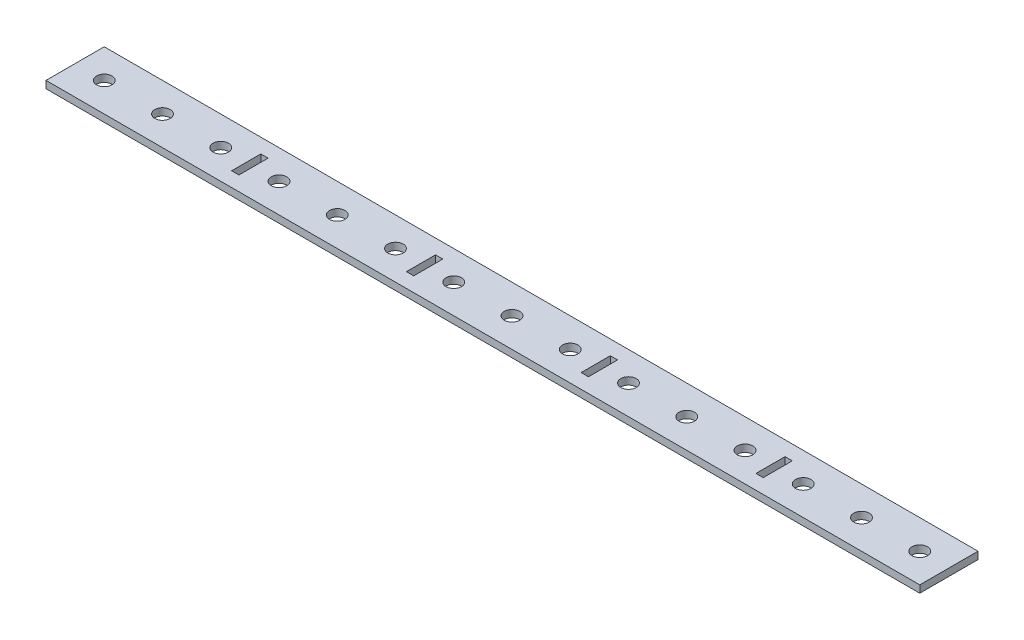
ISO-10303-21;
HEADER;
FILE_DESCRIPTION(('STEP AP214'),'2;1');
FILE_NAME('part.step','',(''),(''),'','','');
FILE_SCHEMA(('AUTOMOTIVE_DESIGN { 1 0 10303 214 1 1 1 1 }'));
ENDSEC;
DATA;
#1=APPLICATION_CONTEXT('core data for automotive mechanical design processes');
#2=APPLICATION_PROTOCOL_DEFINITION('international standard','automotive_design',2000,#1);
#3=PRODUCT_CONTEXT('',#1,'mechanical');
#4=PRODUCT('Part','Part','',(#3));
#5=PRODUCT_RELATED_PRODUCT_CATEGORY('part','',(#4));
#6=PRODUCT_DEFINITION_FORMATION('','',#4);
#7=PRODUCT_DEFINITION_CONTEXT('part definition',#1,'design');
#8=PRODUCT_DEFINITION('design','',#6,#7);
#9=PRODUCT_DEFINITION_SHAPE('','',#8);
#10=(LENGTH_UNIT() NAMED_UNIT(*) SI_UNIT(.MILLI.,.METRE.));
#11=(NAMED_UNIT(*) PLANE_ANGLE_UNIT() SI_UNIT($,.RADIAN.));
#12=(NAMED_UNIT(*) SI_UNIT($,.STERADIAN.) SOLID_ANGLE_UNIT());
#13=UNCERTAINTY_MEASURE_WITH_UNIT(LENGTH_MEASURE(1.E-05),#10,'distance_accuracy_value','');
#14=(GEOMETRIC_REPRESENTATION_CONTEXT(3) GLOBAL_UNCERTAINTY_ASSIGNED_CONTEXT((#13)) GLOBAL_UNIT_ASSIGNED_CONTEXT((#10,
#11,#12)) REPRESENTATION_CONTEXT('',''));
#15=CARTESIAN_POINT('',(0.,0.,0.));
#16=DIRECTION('',(0.,0.,1.));
#17=DIRECTION('',(1.,0.,0.));
#18=AXIS2_PLACEMENT_3D('',#15,#16,#17);
#19=CARTESIAN_POINT('',(303.2125,0.,-6.35));
#20=DIRECTION('',(0.,0.,1.));
#21=DIRECTION('',(1.,0.,0.));
#22=AXIS2_PLACEMENT_3D('',#19,#20,#21);
#23=PLANE('',#22);
#24=DIRECTION('',(1.,0.,0.));
#25=VECTOR('',#24,1.);
#26=CARTESIAN_POINT('',(303.2125,3.175,-6.35));
#27=LINE('',#26,#25);
#28=CARTESIAN_POINT('',(303.2125,3.175,-6.35));
#29=VERTEX_POINT('',#28);
#30=CARTESIAN_POINT('',(306.3875,3.175,-6.35));
#31=VERTEX_POINT('',#30);
#32=EDGE_CURVE('E404',#29,#31,#27,.T.);
#33=ORIENTED_EDGE('',*,*,#32,.T.);
#34=DIRECTION('',(0.,1.,0.));
#35=VECTOR('',#34,1.);
#36=CARTESIAN_POINT('',(306.3875,0.,-6.35));
#37=LINE('',#36,#35);
#38=CARTESIAN_POINT('',(306.3875,0.,-6.35));
#39=VERTEX_POINT('',#38);
#40=EDGE_CURVE('E11',#39,#31,#37,.T.);
#41=ORIENTED_EDGE('',*,*,#40,.F.);
#42=DIRECTION('',(1.,0.,0.));
#43=VECTOR('',#42,1.);
#44=CARTESIAN_POINT('',(303.2125,0.,-6.35));
#45=LINE('',#44,#43);
#46=CARTESIAN_POINT('',(303.2125,0.,-6.35));
#47=VERTEX_POINT('',#46);
#48=EDGE_CURVE('E408',#47,#39,#45,.T.);
#49=ORIENTED_EDGE('',*,*,#48,.F.);
#50=DIRECTION('',(0.,1.,0.));
#51=VECTOR('',#50,1.);
#52=CARTESIAN_POINT('',(303.2125,0.,-6.35));
#53=LINE('',#52,#51);
#54=EDGE_CURVE('E413',#47,#29,#53,.T.);
#55=ORIENTED_EDGE('',*,*,#54,.T.);
#56=EDGE_LOOP('',(#33,#41,#49,#55));
#57=FACE_BOUND('',#56,.T.);
#58=ADVANCED_FACE('F33',(#57),#23,.F.);
#59=CARTESIAN_POINT('',(306.3875,0.,-19.05));
#60=DIRECTION('',(1.,0.,0.));
#61=DIRECTION('',(0.,0.,-1.));
#62=AXIS2_PLACEMENT_3D('',#59,#60,#61);
#63=PLANE('',#62);
#64=DIRECTION('',(0.,0.,-1.));
#65=VECTOR('',#64,1.);
#66=CARTESIAN_POINT('',(306.3875,3.175,-19.05));
#67=LINE('',#66,#65);
#68=CARTESIAN_POINT('',(306.3875,3.175,-19.05));
#69=VERTEX_POINT('',#68);
#70=EDGE_CURVE('E401',#31,#69,#67,.T.);
#71=ORIENTED_EDGE('',*,*,#70,.T.);
#72=DIRECTION('',(0.,1.,0.));
#73=VECTOR('',#72,1.);
#74=CARTESIAN_POINT('',(306.3875,0.,-19.05));
#75=LINE('',#74,#73);
#76=CARTESIAN_POINT('',(306.3875,0.,-19.05));
#77=VERTEX_POINT('',#76);
#78=EDGE_CURVE('E40',#77,#69,#75,.T.);
#79=ORIENTED_EDGE('',*,*,#78,.F.);
#80=DIRECTION('',(0.,0.,-1.));
#81=VECTOR('',#80,1.);
#82=CARTESIAN_POINT('',(306.3875,0.,-19.05));
#83=LINE('',#82,#81);
#84=EDGE_CURVE('E54',#39,#77,#83,.T.);
#85=ORIENTED_EDGE('',*,*,#84,.F.);
#86=ORIENTED_EDGE('',*,*,#40,.T.);
#87=EDGE_LOOP('',(#71,#79,#85,#86));
#88=FACE_BOUND('',#87,.T.);
#89=ADVANCED_FACE('F423',(#88),#63,.F.);
#90=CARTESIAN_POINT('',(303.2125,0.,-19.05));
#91=DIRECTION('',(0.,0.,-1.));
#92=DIRECTION('',(-1.,0.,0.));
#93=AXIS2_PLACEMENT_3D('',#90,#91,#92);
#94=PLANE('',#93);
#95=DIRECTION('',(-1.,0.,0.));
#96=VECTOR('',#95,1.);
#97=CARTESIAN_POINT('',(303.2125,3.175,-19.05));
#98=LINE('',#97,#96);
#99=CARTESIAN_POINT('',(303.2125,3.175,-19.05));
#100=VERTEX_POINT('',#99);
#101=EDGE_CURVE('E398',#69,#100,#98,.T.);
#102=ORIENTED_EDGE('',*,*,#101,.T.);
#103=DIRECTION('',(0.,1.,0.));
#104=VECTOR('',#103,1.);
#105=CARTESIAN_POINT('',(303.2125,0.,-19.05));
#106=LINE('',#105,#104);
#107=CARTESIAN_POINT('',(303.2125,0.,-19.05));
#108=VERTEX_POINT('',#107);
#109=EDGE_CURVE('E416',#108,#100,#106,.T.);
#110=ORIENTED_EDGE('',*,*,#109,.F.);
#111=DIRECTION('',(-1.,0.,0.));
#112=VECTOR('',#111,1.);
#113=CARTESIAN_POINT('',(303.2125,0.,-19.05));
#114=LINE('',#113,#112);
#115=EDGE_CURVE('E411',#77,#108,#114,.T.);
#116=ORIENTED_EDGE('',*,*,#115,.F.);
#117=ORIENTED_EDGE('',*,*,#78,.T.);
#118=EDGE_LOOP('',(#102,#110,#116,#117));
#119=FACE_BOUND('',#118,.T.);
#120=ADVANCED_FACE('F420',(#119),#94,.F.);
#121=CARTESIAN_POINT('',(303.2125,0.,-19.05));
#122=DIRECTION('',(-1.,0.,0.));
#123=DIRECTION('',(0.,0.,1.));
#124=AXIS2_PLACEMENT_3D('',#121,#122,#123);
#125=PLANE('',#124);
#126=DIRECTION('',(0.,0.,1.));
#127=VECTOR('',#126,1.);
#128=CARTESIAN_POINT('',(303.2125,3.175,-19.05));
#129=LINE('',#128,#127);
#130=EDGE_CURVE('E396',#100,#29,#129,.T.);
#131=ORIENTED_EDGE('',*,*,#130,.T.);
#132=ORIENTED_EDGE('',*,*,#54,.F.);
#133=DIRECTION('',(0.,0.,1.));
#134=VECTOR('',#133,1.);
#135=CARTESIAN_POINT('',(303.2125,0.,-19.05));
#136=LINE('',#135,#134);
#137=EDGE_CURVE('E47',#108,#47,#136,.T.);
#138=ORIENTED_EDGE('',*,*,#137,.F.);
#139=ORIENTED_EDGE('',*,*,#109,.T.);
#140=EDGE_LOOP('',(#131,#132,#138,#139));
#141=FACE_BOUND('',#140,.T.);
#142=ADVANCED_FACE('F429',(#141),#125,.F.);
#143=CARTESIAN_POINT('',(227.0125,0.,-6.35));
#144=DIRECTION('',(0.,0.,1.));
#145=DIRECTION('',(1.,0.,0.));
#146=AXIS2_PLACEMENT_3D('',#143,#144,#145);
#147=PLANE('',#146);
#148=DIRECTION('',(1.,0.,0.));
#149=VECTOR('',#148,1.);
#150=CARTESIAN_POINT('',(227.0125,3.175,-6.35));
#151=LINE('',#150,#149);
#152=CARTESIAN_POINT('',(227.0125,3.175,-6.35));
#153=VERTEX_POINT('',#152);
#154=CARTESIAN_POINT('',(230.1875,3.175,-6.35));
#155=VERTEX_POINT('',#154);
#156=EDGE_CURVE('E372',#153,#155,#151,.T.);
#157=ORIENTED_EDGE('',*,*,#156,.T.);
#158=DIRECTION('',(0.,1.,0.));
#159=VECTOR('',#158,1.);
#160=CARTESIAN_POINT('',(230.1875,0.,-6.35));
#161=LINE('',#160,#159);
#162=CARTESIAN_POINT('',(230.1875,0.,-6.35));
#163=VERTEX_POINT('',#162);
#164=EDGE_CURVE('E393',#163,#155,#161,.T.);
#165=ORIENTED_EDGE('',*,*,#164,.F.);
#166=DIRECTION('',(1.,0.,0.));
#167=VECTOR('',#166,1.);
#168=CARTESIAN_POINT('',(227.0125,0.,-6.35));
#169=LINE('',#168,#167);
#170=CARTESIAN_POINT('',(227.0125,0.,-6.35));
#171=VERTEX_POINT('',#170);
#172=EDGE_CURVE('E377',#171,#163,#169,.T.);
#173=ORIENTED_EDGE('',*,*,#172,.F.);
#174=DIRECTION('',(0.,1.,0.));
#175=VECTOR('',#174,1.);
#176=CARTESIAN_POINT('',(227.0125,0.,-6.35));
#177=LINE('',#176,#175);
#178=EDGE_CURVE('E384',#171,#153,#177,.T.);
#179=ORIENTED_EDGE('',*,*,#178,.T.);
#180=EDGE_LOOP('',(#157,#165,#173,#179));
#181=FACE_BOUND('',#180,.T.);
#182=ADVANCED_FACE('F431',(#181),#147,.F.);
#183=CARTESIAN_POINT('',(230.1875,0.,-19.05));
#184=DIRECTION('',(1.,0.,0.));
#185=DIRECTION('',(0.,0.,-1.));
#186=AXIS2_PLACEMENT_3D('',#183,#184,#185);
#187=PLANE('',#186);
#188=DIRECTION('',(0.,0.,-1.));
#189=VECTOR('',#188,1.);
#190=CARTESIAN_POINT('',(230.1875,3.175,-19.05));
#191=LINE('',#190,#189);
#192=CARTESIAN_POINT('',(230.1875,3.175,-19.05));
#193=VERTEX_POINT('',#192);
#194=EDGE_CURVE('E369',#155,#193,#191,.T.);
#195=ORIENTED_EDGE('',*,*,#194,.T.);
#196=DIRECTION('',(0.,1.,0.));
#197=VECTOR('',#196,1.);
#198=CARTESIAN_POINT('',(230.1875,0.,-19.05));
#199=LINE('',#198,#197);
#200=CARTESIAN_POINT('',(230.1875,0.,-19.05));
#201=VERTEX_POINT('',#200);
#202=EDGE_CURVE('E390',#201,#193,#199,.T.);
#203=ORIENTED_EDGE('',*,*,#202,.F.);
#204=DIRECTION('',(0.,0.,-1.));
#205=VECTOR('',#204,1.);
#206=CARTESIAN_POINT('',(230.1875,0.,-19.05));
#207=LINE('',#206,#205);
#208=EDGE_CURVE('E379',#163,#201,#207,.T.);
#209=ORIENTED_EDGE('',*,*,#208,.F.);
#210=ORIENTED_EDGE('',*,*,#164,.T.);
#211=EDGE_LOOP('',(#195,#203,#209,#210));
#212=FACE_BOUND('',#211,.T.);
#213=ADVANCED_FACE('F437',(#212),#187,.F.);
#214=CARTESIAN_POINT('',(227.0125,0.,-19.05));
#215=DIRECTION('',(0.,0.,-1.));
#216=DIRECTION('',(-1.,0.,0.));
#217=AXIS2_PLACEMENT_3D('',#214,#215,#216);
#218=PLANE('',#217);
#219=DIRECTION('',(-1.,0.,0.));
#220=VECTOR('',#219,1.);
#221=CARTESIAN_POINT('',(227.0125,3.175,-19.05));
#222=LINE('',#221,#220);
#223=CARTESIAN_POINT('',(227.0125,3.175,-19.05));
#224=VERTEX_POINT('',#223);
#225=EDGE_CURVE('E366',#193,#224,#222,.T.);
#226=ORIENTED_EDGE('',*,*,#225,.T.);
#227=DIRECTION('',(0.,1.,0.));
#228=VECTOR('',#227,1.);
#229=CARTESIAN_POINT('',(227.0125,0.,-19.05));
#230=LINE('',#229,#228);
#231=CARTESIAN_POINT('',(227.0125,0.,-19.05));
#232=VERTEX_POINT('',#231);
#233=EDGE_CURVE('E387',#232,#224,#230,.T.);
#234=ORIENTED_EDGE('',*,*,#233,.F.);
#235=DIRECTION('',(-1.,0.,0.));
#236=VECTOR('',#235,1.);
#237=CARTESIAN_POINT('',(227.0125,0.,-19.05));
#238=LINE('',#237,#236);
#239=EDGE_CURVE('E381',#201,#232,#238,.T.);
#240=ORIENTED_EDGE('',*,*,#239,.F.);
#241=ORIENTED_EDGE('',*,*,#202,.T.);
#242=EDGE_LOOP('',(#226,#234,#240,#241));
#243=FACE_BOUND('',#242,.T.);
#244=ADVANCED_FACE('F470',(#243),#218,.F.);
#245=CARTESIAN_POINT('',(227.0125,0.,-19.05));
#246=DIRECTION('',(-1.,0.,0.));
#247=DIRECTION('',(0.,0.,1.));
#248=AXIS2_PLACEMENT_3D('',#245,#246,#247);
#249=PLANE('',#248);
#250=DIRECTION('',(0.,0.,1.));
#251=VECTOR('',#250,1.);
#252=CARTESIAN_POINT('',(227.0125,3.175,-19.05));
#253=LINE('',#252,#251);
#254=EDGE_CURVE('E364',#224,#153,#253,.T.);
#255=ORIENTED_EDGE('',*,*,#254,.T.);
#256=ORIENTED_EDGE('',*,*,#178,.F.);
#257=DIRECTION('',(0.,0.,1.));
#258=VECTOR('',#257,1.);
#259=CARTESIAN_POINT('',(227.0125,0.,-19.05));
#260=LINE('',#259,#258);
#261=EDGE_CURVE('E375',#232,#171,#260,.T.);
#262=ORIENTED_EDGE('',*,*,#261,.F.);
#263=ORIENTED_EDGE('',*,*,#233,.T.);
#264=EDGE_LOOP('',(#255,#256,#262,#263));
#265=FACE_BOUND('',#264,.T.);
#266=ADVANCED_FACE('F480',(#265),#249,.F.);
#267=CARTESIAN_POINT('',(368.3,3.175,-12.7));
#268=DIRECTION('',(0.,1.,0.));
#269=DIRECTION('',(0.,0.,1.));
#270=AXIS2_PLACEMENT_3D('',#267,#268,#269);
#271=CYLINDRICAL_SURFACE('',#270,3.3782);
#272=CARTESIAN_POINT('',(368.3,0.,-12.7));
#273=DIRECTION('',(0.,1.,0.));
#274=DIRECTION('',(0.,0.,1.));
#275=AXIS2_PLACEMENT_3D('',#272,#273,#274);
#276=CIRCLE('',#275,3.3782);
#277=CARTESIAN_POINT('',(368.3,0.,-9.3218));
#278=VERTEX_POINT('',#277);
#279=EDGE_CURVE('E358',#278,#278,#276,.T.);
#280=ORIENTED_EDGE('',*,*,#279,.F.);
#281=EDGE_LOOP('',(#280));
#282=FACE_BOUND('',#281,.T.);
#283=CARTESIAN_POINT('',(368.3,3.175,-12.7));
#284=DIRECTION('',(0.,1.,0.));
#285=DIRECTION('',(0.,0.,1.));
#286=AXIS2_PLACEMENT_3D('',#283,#284,#285);
#287=CIRCLE('',#286,3.3782);
#288=CARTESIAN_POINT('',(368.3,3.175,-9.3218));
#289=VERTEX_POINT('',#288);
#290=EDGE_CURVE('E361',#289,#289,#287,.T.);
#291=ORIENTED_EDGE('',*,*,#290,.T.);
#292=EDGE_LOOP('',(#291));
#293=FACE_BOUND('',#292,.T.);
#294=ADVANCED_FACE('F490',(#282,#293),#271,.F.);
#295=CARTESIAN_POINT('',(342.9,3.175,-12.7));
#296=DIRECTION('',(0.,1.,0.));
#297=DIRECTION('',(0.,0.,1.));
#298=AXIS2_PLACEMENT_3D('',#295,#296,#297);
#299=CYLINDRICAL_SURFACE('',#298,3.3782);
#300=CARTESIAN_POINT('',(342.9,0.,-12.7));
#301=DIRECTION('',(0.,1.,0.));
#302=DIRECTION('',(0.,0.,1.));
#303=AXIS2_PLACEMENT_3D('',#300,#301,#302);
#304=CIRCLE('',#303,3.3782);
#305=CARTESIAN_POINT('',(342.9,0.,-9.3218));
#306=VERTEX_POINT('',#305);
#307=EDGE_CURVE('E352',#306,#306,#304,.T.);
#308=ORIENTED_EDGE('',*,*,#307,.F.);
#309=EDGE_LOOP('',(#308));
#310=FACE_BOUND('',#309,.T.);
#311=CARTESIAN_POINT('',(342.9,3.175,-12.7));
#312=DIRECTION('',(0.,1.,0.));
#313=DIRECTION('',(0.,0.,1.));
#314=AXIS2_PLACEMENT_3D('',#311,#312,#313);
#315=CIRCLE('',#314,3.3782);
#316=CARTESIAN_POINT('',(342.9,3.175,-9.3218));
#317=VERTEX_POINT('',#316);
#318=EDGE_CURVE('E355',#317,#317,#315,.T.);
#319=ORIENTED_EDGE('',*,*,#318,.T.);
#320=EDGE_LOOP('',(#319));
#321=FACE_BOUND('',#320,.T.);
#322=ADVANCED_FACE('F636',(#310,#321),#299,.F.);
#323=CARTESIAN_POINT('',(317.5,3.175,-12.7));
#324=DIRECTION('',(0.,1.,0.));
#325=DIRECTION('',(0.,0.,1.));
#326=AXIS2_PLACEMENT_3D('',#323,#324,#325);
#327=CYLINDRICAL_SURFACE('',#326,3.3782);
#328=CARTESIAN_POINT('',(317.5,0.,-12.7));
#329=DIRECTION('',(0.,1.,0.));
#330=DIRECTION('',(0.,0.,1.));
#331=AXIS2_PLACEMENT_3D('',#328,#329,#330);
#332=CIRCLE('',#331,3.3782);
#333=CARTESIAN_POINT('',(317.5,0.,-9.3218));
#334=VERTEX_POINT('',#333);
#335=EDGE_CURVE('E346',#334,#334,#332,.T.);
#336=ORIENTED_EDGE('',*,*,#335,.F.);
#337=EDGE_LOOP('',(#336));
#338=FACE_BOUND('',#337,.T.);
#339=CARTESIAN_POINT('',(317.5,3.175,-12.7));
#340=DIRECTION('',(0.,1.,0.));
#341=DIRECTION('',(0.,0.,1.));
#342=AXIS2_PLACEMENT_3D('',#339,#340,#341);
#343=CIRCLE('',#342,3.3782);
#344=CARTESIAN_POINT('',(317.5,3.175,-9.3218));
#345=VERTEX_POINT('',#344);
#346=EDGE_CURVE('E349',#345,#345,#343,.T.);
#347=ORIENTED_EDGE('',*,*,#346,.T.);
#348=EDGE_LOOP('',(#347));
#349=FACE_BOUND('',#348,.T.);
#350=ADVANCED_FACE('F632',(#338,#349),#327,.F.);
#351=CARTESIAN_POINT('',(292.1,3.175,-12.7));
#352=DIRECTION('',(0.,1.,0.));
#353=DIRECTION('',(0.,0.,1.));
#354=AXIS2_PLACEMENT_3D('',#351,#352,#353);
#355=CYLINDRICAL_SURFACE('',#354,3.3782);
#356=CARTESIAN_POINT('',(292.1,0.,-12.7));
#357=DIRECTION('',(0.,1.,0.));
#358=DIRECTION('',(0.,0.,1.));
#359=AXIS2_PLACEMENT_3D('',#356,#357,#358);
#360=CIRCLE('',#359,3.3782);
#361=CARTESIAN_POINT('',(292.1,0.,-9.3218));
#362=VERTEX_POINT('',#361);
#363=EDGE_CURVE('E340',#362,#362,#360,.T.);
#364=ORIENTED_EDGE('',*,*,#363,.F.);
#365=EDGE_LOOP('',(#364));
#366=FACE_BOUND('',#365,.T.);
#367=CARTESIAN_POINT('',(292.1,3.175,-12.7));
#368=DIRECTION('',(0.,1.,0.));
#369=DIRECTION('',(0.,0.,1.));
#370=AXIS2_PLACEMENT_3D('',#367,#368,#369);
#371=CIRCLE('',#370,3.3782);
#372=CARTESIAN_POINT('',(292.1,3.175,-9.3218));
#373=VERTEX_POINT('',#372);
#374=EDGE_CURVE('E343',#373,#373,#371,.T.);
#375=ORIENTED_EDGE('',*,*,#374,.T.);
#376=EDGE_LOOP('',(#375));
#377=FACE_BOUND('',#376,.T.);
#378=ADVANCED_FACE('F628',(#366,#377),#355,.F.);
#379=CARTESIAN_POINT('',(266.7,3.175,-12.7));
#380=DIRECTION('',(0.,1.,0.));
#381=DIRECTION('',(0.,0.,1.));
#382=AXIS2_PLACEMENT_3D('',#379,#380,#381);
#383=CYLINDRICAL_SURFACE('',#382,3.3782);
#384=CARTESIAN_POINT('',(266.7,0.,-12.7));
#385=DIRECTION('',(0.,1.,0.));
#386=DIRECTION('',(0.,0.,1.));
#387=AXIS2_PLACEMENT_3D('',#384,#385,#386);
#388=CIRCLE('',#387,3.3782);
#389=CARTESIAN_POINT('',(266.7,0.,-9.3218));
#390=VERTEX_POINT('',#389);
#391=EDGE_CURVE('E334',#390,#390,#388,.T.);
#392=ORIENTED_EDGE('',*,*,#391,.F.);
#393=EDGE_LOOP('',(#392));
#394=FACE_BOUND('',#393,.T.);
#395=CARTESIAN_POINT('',(266.7,3.175,-12.7));
#396=DIRECTION('',(0.,1.,0.));
#397=DIRECTION('',(0.,0.,1.));
#398=AXIS2_PLACEMENT_3D('',#395,#396,#397);
#399=CIRCLE('',#398,3.3782);
#400=CARTESIAN_POINT('',(266.7,3.175,-9.3218));
#401=VERTEX_POINT('',#400);
#402=EDGE_CURVE('E337',#401,#401,#399,.T.);
#403=ORIENTED_EDGE('',*,*,#402,.T.);
#404=EDGE_LOOP('',(#403));
#405=FACE_BOUND('',#404,.T.);
#406=ADVANCED_FACE('F624',(#394,#405),#383,.F.);
#407=CARTESIAN_POINT('',(241.3,3.175,-12.7));
#408=DIRECTION('',(0.,1.,0.));
#409=DIRECTION('',(0.,0.,1.));
#410=AXIS2_PLACEMENT_3D('',#407,#408,#409);
#411=CYLINDRICAL_SURFACE('',#410,3.3782);
#412=CARTESIAN_POINT('',(241.3,0.,-12.7));
#413=DIRECTION('',(0.,1.,0.));
#414=DIRECTION('',(0.,0.,1.));
#415=AXIS2_PLACEMENT_3D('',#412,#413,#414);
#416=CIRCLE('',#415,3.3782);
#417=CARTESIAN_POINT('',(241.3,0.,-9.3218));
#418=VERTEX_POINT('',#417);
#419=EDGE_CURVE('E328',#418,#418,#416,.T.);
#420=ORIENTED_EDGE('',*,*,#419,.F.);
#421=EDGE_LOOP('',(#420));
#422=FACE_BOUND('',#421,.T.);
#423=CARTESIAN_POINT('',(241.3,3.175,-12.7));
#424=DIRECTION('',(0.,1.,0.));
#425=DIRECTION('',(0.,0.,1.));
#426=AXIS2_PLACEMENT_3D('',#423,#424,#425);
#427=CIRCLE('',#426,3.3782);
#428=CARTESIAN_POINT('',(241.3,3.175,-9.3218));
#429=VERTEX_POINT('',#428);
#430=EDGE_CURVE('E331',#429,#429,#427,.T.);
#431=ORIENTED_EDGE('',*,*,#430,.T.);
#432=EDGE_LOOP('',(#431));
#433=FACE_BOUND('',#432,.T.);
#434=ADVANCED_FACE('F620',(#422,#433),#411,.F.);
#435=CARTESIAN_POINT('',(215.9,3.175,-12.7));
#436=DIRECTION('',(0.,1.,0.));
#437=DIRECTION('',(0.,0.,1.));
#438=AXIS2_PLACEMENT_3D('',#435,#436,#437);
#439=CYLINDRICAL_SURFACE('',#438,3.3782);
#440=CARTESIAN_POINT('',(215.9,0.,-12.7));
#441=DIRECTION('',(0.,1.,0.));
#442=DIRECTION('',(0.,0.,1.));
#443=AXIS2_PLACEMENT_3D('',#440,#441,#442);
#444=CIRCLE('',#443,3.3782);
#445=CARTESIAN_POINT('',(215.9,0.,-9.3218));
#446=VERTEX_POINT('',#445);
#447=EDGE_CURVE('E322',#446,#446,#444,.T.);
#448=ORIENTED_EDGE('',*,*,#447,.F.);
#449=EDGE_LOOP('',(#448));
#450=FACE_BOUND('',#449,.T.);
#451=CARTESIAN_POINT('',(215.9,3.175,-12.7));
#452=DIRECTION('',(0.,1.,0.));
#453=DIRECTION('',(0.,0.,1.));
#454=AXIS2_PLACEMENT_3D('',#451,#452,#453);
#455=CIRCLE('',#454,3.3782);
#456=CARTESIAN_POINT('',(215.9,3.175,-9.3218));
#457=VERTEX_POINT('',#456);
#458=EDGE_CURVE('E325',#457,#457,#455,.T.);
#459=ORIENTED_EDGE('',*,*,#458,.T.);
#460=EDGE_LOOP('',(#459));
#461=FACE_BOUND('',#460,.T.);
#462=ADVANCED_FACE('F616',(#450,#461),#439,.F.);
#463=CARTESIAN_POINT('',(190.5,3.175,-12.7));
#464=DIRECTION('',(0.,1.,0.));
#465=DIRECTION('',(0.,0.,1.));
#466=AXIS2_PLACEMENT_3D('',#463,#464,#465);
#467=CYLINDRICAL_SURFACE('',#466,3.3782);
#468=CARTESIAN_POINT('',(190.5,0.,-12.7));
#469=DIRECTION('',(0.,1.,0.));
#470=DIRECTION('',(0.,0.,1.));
#471=AXIS2_PLACEMENT_3D('',#468,#469,#470);
#472=CIRCLE('',#471,3.3782);
#473=CARTESIAN_POINT('',(190.5,0.,-9.3218));
#474=VERTEX_POINT('',#473);
#475=EDGE_CURVE('E316',#474,#474,#472,.T.);
#476=ORIENTED_EDGE('',*,*,#475,.F.);
#477=EDGE_LOOP('',(#476));
#478=FACE_BOUND('',#477,.T.);
#479=CARTESIAN_POINT('',(190.5,3.175,-12.7));
#480=DIRECTION('',(0.,1.,0.));
#481=DIRECTION('',(0.,0.,1.));
#482=AXIS2_PLACEMENT_3D('',#479,#480,#481);
#483=CIRCLE('',#482,3.3782);
#484=CARTESIAN_POINT('',(190.5,3.175,-9.3218));
#485=VERTEX_POINT('',#484);
#486=EDGE_CURVE('E319',#485,#485,#483,.T.);
#487=ORIENTED_EDGE('',*,*,#486,.T.);
#488=EDGE_LOOP('',(#487));
#489=FACE_BOUND('',#488,.T.);
#490=ADVANCED_FACE('F612',(#478,#489),#467,.F.);
#491=CARTESIAN_POINT('',(165.1,3.175,-12.7));
#492=DIRECTION('',(0.,1.,0.));
#493=DIRECTION('',(0.,0.,1.));
#494=AXIS2_PLACEMENT_3D('',#491,#492,#493);
#495=CYLINDRICAL_SURFACE('',#494,3.3782);
#496=CARTESIAN_POINT('',(165.1,0.,-12.7));
#497=DIRECTION('',(0.,1.,0.));
#498=DIRECTION('',(0.,0.,1.));
#499=AXIS2_PLACEMENT_3D('',#496,#497,#498);
#500=CIRCLE('',#499,3.3782);
#501=CARTESIAN_POINT('',(165.1,0.,-9.3218));
#502=VERTEX_POINT('',#501);
#503=EDGE_CURVE('E310',#502,#502,#500,.T.);
#504=ORIENTED_EDGE('',*,*,#503,.F.);
#505=EDGE_LOOP('',(#504));
#506=FACE_BOUND('',#505,.T.);
#507=CARTESIAN_POINT('',(165.1,3.175,-12.7));
#508=DIRECTION('',(0.,1.,0.));
#509=DIRECTION('',(0.,0.,1.));
#510=AXIS2_PLACEMENT_3D('',#507,#508,#509);
#511=CIRCLE('',#510,3.3782);
#512=CARTESIAN_POINT('',(165.1,3.175,-9.3218));
#513=VERTEX_POINT('',#512);
#514=EDGE_CURVE('E313',#513,#513,#511,.T.);
#515=ORIENTED_EDGE('',*,*,#514,.T.);
#516=EDGE_LOOP('',(#515));
#517=FACE_BOUND('',#516,.T.);
#518=ADVANCED_FACE('F608',(#506,#517),#495,.F.);
#519=CARTESIAN_POINT('',(139.7,3.175,-12.7));
#520=DIRECTION('',(0.,1.,0.));
#521=DIRECTION('',(0.,0.,1.));
#522=AXIS2_PLACEMENT_3D('',#519,#520,#521);
#523=CYLINDRICAL_SURFACE('',#522,3.3782);
#524=CARTESIAN_POINT('',(139.7,0.,-12.7));
#525=DIRECTION('',(0.,1.,0.));
#526=DIRECTION('',(0.,0.,1.));
#527=AXIS2_PLACEMENT_3D('',#524,#525,#526);
#528=CIRCLE('',#527,3.3782);
#529=CARTESIAN_POINT('',(139.7,0.,-9.3218));
#530=VERTEX_POINT('',#529);
#531=EDGE_CURVE('E304',#530,#530,#528,.T.);
#532=ORIENTED_EDGE('',*,*,#531,.F.);
#533=EDGE_LOOP('',(#532));
#534=FACE_BOUND('',#533,.T.);
#535=CARTESIAN_POINT('',(139.7,3.175,-12.7));
#536=DIRECTION('',(0.,1.,0.));
#537=DIRECTION('',(0.,0.,1.));
#538=AXIS2_PLACEMENT_3D('',#535,#536,#537);
#539=CIRCLE('',#538,3.3782);
#540=CARTESIAN_POINT('',(139.7,3.175,-9.3218));
#541=VERTEX_POINT('',#540);
#542=EDGE_CURVE('E307',#541,#541,#539,.T.);
#543=ORIENTED_EDGE('',*,*,#542,.T.);
#544=EDGE_LOOP('',(#543));
#545=FACE_BOUND('',#544,.T.);
#546=ADVANCED_FACE('F604',(#534,#545),#523,.F.);
#547=CARTESIAN_POINT('',(114.3,3.175,-12.7));
#548=DIRECTION('',(0.,1.,0.));
#549=DIRECTION('',(0.,0.,1.));
#550=AXIS2_PLACEMENT_3D('',#547,#548,#549);
#551=CYLINDRICAL_SURFACE('',#550,3.3782);
#552=CARTESIAN_POINT('',(114.3,0.,-12.7));
#553=DIRECTION('',(0.,1.,0.));
#554=DIRECTION('',(0.,0.,1.));
#555=AXIS2_PLACEMENT_3D('',#552,#553,#554);
#556=CIRCLE('',#555,3.3782);
#557=CARTESIAN_POINT('',(114.3,0.,-9.3218));
#558=VERTEX_POINT('',#557);
#559=EDGE_CURVE('E298',#558,#558,#556,.T.);
#560=ORIENTED_EDGE('',*,*,#559,.F.);
#561=EDGE_LOOP('',(#560));
#562=FACE_BOUND('',#561,.T.);
#563=CARTESIAN_POINT('',(114.3,3.175,-12.7));
#564=DIRECTION('',(0.,1.,0.));
#565=DIRECTION('',(0.,0.,1.));
#566=AXIS2_PLACEMENT_3D('',#563,#564,#565);
#567=CIRCLE('',#566,3.3782);
#568=CARTESIAN_POINT('',(114.3,3.175,-9.3218));
#569=VERTEX_POINT('',#568);
#570=EDGE_CURVE('E301',#569,#569,#567,.T.);
#571=ORIENTED_EDGE('',*,*,#570,.T.);
#572=EDGE_LOOP('',(#571));
#573=FACE_BOUND('',#572,.T.);
#574=ADVANCED_FACE('F600',(#562,#573),#551,.F.);
#575=CARTESIAN_POINT('',(88.9,3.175,-12.7));
#576=DIRECTION('',(0.,1.,0.));
#577=DIRECTION('',(0.,0.,1.));
#578=AXIS2_PLACEMENT_3D('',#575,#576,#577);
#579=CYLINDRICAL_SURFACE('',#578,3.3782);
#580=CARTESIAN_POINT('',(88.9,0.,-12.7));
#581=DIRECTION('',(0.,1.,0.));
#582=DIRECTION('',(0.,0.,1.));
#583=AXIS2_PLACEMENT_3D('',#580,#581,#582);
#584=CIRCLE('',#583,3.3782);
#585=CARTESIAN_POINT('',(88.9,0.,-9.3218));
#586=VERTEX_POINT('',#585);
#587=EDGE_CURVE('E292',#586,#586,#584,.T.);
#588=ORIENTED_EDGE('',*,*,#587,.F.);
#589=EDGE_LOOP('',(#588));
#590=FACE_BOUND('',#589,.T.);
#591=CARTESIAN_POINT('',(88.9,3.175,-12.7));
#592=DIRECTION('',(0.,1.,0.));
#593=DIRECTION('',(0.,0.,1.));
#594=AXIS2_PLACEMENT_3D('',#591,#592,#593);
#595=CIRCLE('',#594,3.3782);
#596=CARTESIAN_POINT('',(88.9,3.175,-9.3218));
#597=VERTEX_POINT('',#596);
#598=EDGE_CURVE('E295',#597,#597,#595,.T.);
#599=ORIENTED_EDGE('',*,*,#598,.T.);
#600=EDGE_LOOP('',(#599));
#601=FACE_BOUND('',#600,.T.);
#602=ADVANCED_FACE('F596',(#590,#601),#579,.F.);
#603=CARTESIAN_POINT('',(63.5,3.175,-12.7));
#604=DIRECTION('',(0.,1.,0.));
#605=DIRECTION('',(0.,0.,1.));
#606=AXIS2_PLACEMENT_3D('',#603,#604,#605);
#607=CYLINDRICAL_SURFACE('',#606,3.3782);
#608=CARTESIAN_POINT('',(63.5,0.,-12.7));
#609=DIRECTION('',(0.,1.,0.));
#610=DIRECTION('',(0.,0.,1.));
#611=AXIS2_PLACEMENT_3D('',#608,#609,#610);
#612=CIRCLE('',#611,3.3782);
#613=CARTESIAN_POINT('',(63.5,0.,-9.3218));
#614=VERTEX_POINT('',#613);
#615=EDGE_CURVE('E286',#614,#614,#612,.T.);
#616=ORIENTED_EDGE('',*,*,#615,.F.);
#617=EDGE_LOOP('',(#616));
#618=FACE_BOUND('',#617,.T.);
#619=CARTESIAN_POINT('',(63.5,3.175,-12.7));
#620=DIRECTION('',(0.,1.,0.));
#621=DIRECTION('',(0.,0.,1.));
#622=AXIS2_PLACEMENT_3D('',#619,#620,#621);
#623=CIRCLE('',#622,3.3782);
#624=CARTESIAN_POINT('',(63.5,3.175,-9.3218));
#625=VERTEX_POINT('',#624);
#626=EDGE_CURVE('E289',#625,#625,#623,.T.);
#627=ORIENTED_EDGE('',*,*,#626,.T.);
#628=EDGE_LOOP('',(#627));
#629=FACE_BOUND('',#628,.T.);
#630=ADVANCED_FACE('F592',(#618,#629),#607,.F.);
#631=CARTESIAN_POINT('',(0.,3.175,0.));
#632=DIRECTION('',(1.,0.,0.));
#633=DIRECTION('',(0.,0.,-1.));
#634=AXIS2_PLACEMENT_3D('',#631,#632,#633);
#635=PLANE('',#634);
#636=DIRECTION('',(0.,0.,1.));
#637=VECTOR('',#636,1.);
#638=CARTESIAN_POINT('',(0.,0.,0.));
#639=LINE('',#638,#637);
#640=CARTESIAN_POINT('',(0.,0.,-25.4));
#641=VERTEX_POINT('',#640);
#642=CARTESIAN_POINT('',(0.,0.,0.));
#643=VERTEX_POINT('',#642);
#644=EDGE_CURVE('E256',#641,#643,#639,.T.);
#645=ORIENTED_EDGE('',*,*,#644,.T.);
#646=DIRECTION('',(0.,-1.,0.));
#647=VECTOR('',#646,1.);
#648=CARTESIAN_POINT('',(0.,3.175,0.));
#649=LINE('',#648,#647);
#650=CARTESIAN_POINT('',(0.,3.175,0.));
#651=VERTEX_POINT('',#650);
#652=EDGE_CURVE('E283',#651,#643,#649,.T.);
#653=ORIENTED_EDGE('',*,*,#652,.F.);
#654=DIRECTION('',(0.,0.,1.));
#655=VECTOR('',#654,1.);
#656=CARTESIAN_POINT('',(0.,3.175,0.));
#657=LINE('',#656,#655);
#658=CARTESIAN_POINT('',(0.,3.175,-25.4));
#659=VERTEX_POINT('',#658);
#660=EDGE_CURVE('E257',#659,#651,#657,.T.);
#661=ORIENTED_EDGE('',*,*,#660,.F.);
#662=DIRECTION('',(0.,-1.,0.));
#663=VECTOR('',#662,1.);
#664=CARTESIAN_POINT('',(0.,3.175,-25.4));
#665=LINE('',#664,#663);
#666=EDGE_CURVE('E267',#659,#641,#665,.T.);
#667=ORIENTED_EDGE('',*,*,#666,.T.);
#668=EDGE_LOOP('',(#645,#653,#661,#667));
#669=FACE_BOUND('',#668,.T.);
#670=ADVANCED_FACE('F588',(#669),#635,.F.);
#671=CARTESIAN_POINT('',(0.,3.175,0.));
#672=DIRECTION('',(0.,0.,-1.));
#673=DIRECTION('',(-1.,0.,0.));
#674=AXIS2_PLACEMENT_3D('',#671,#672,#673);
#675=PLANE('',#674);
#676=DIRECTION('',(1.,0.,0.));
#677=VECTOR('',#676,1.);
#678=CARTESIAN_POINT('',(0.,0.,0.));
#679=LINE('',#678,#677);
#680=CARTESIAN_POINT('',(381.,0.,0.));
#681=VERTEX_POINT('',#680);
#682=EDGE_CURVE('E270',#643,#681,#679,.T.);
#683=ORIENTED_EDGE('',*,*,#682,.T.);
#684=DIRECTION('',(0.,-1.,0.));
#685=VECTOR('',#684,1.);
#686=CARTESIAN_POINT('',(381.,3.175,0.));
#687=LINE('',#686,#685);
#688=CARTESIAN_POINT('',(381.,3.175,0.));
#689=VERTEX_POINT('',#688);
#690=EDGE_CURVE('E280',#689,#681,#687,.T.);
#691=ORIENTED_EDGE('',*,*,#690,.F.);
#692=DIRECTION('',(1.,0.,0.));
#693=VECTOR('',#692,1.);
#694=CARTESIAN_POINT('',(0.,3.175,0.));
#695=LINE('',#694,#693);
#696=EDGE_CURVE('E260',#651,#689,#695,.T.);
#697=ORIENTED_EDGE('',*,*,#696,.F.);
#698=ORIENTED_EDGE('',*,*,#652,.T.);
#699=EDGE_LOOP('',(#683,#691,#697,#698));
#700=FACE_BOUND('',#699,.T.);
#701=ADVANCED_FACE('F584',(#700),#675,.F.);
#702=CARTESIAN_POINT('',(381.,3.175,0.));
#703=DIRECTION('',(-1.,0.,0.));
#704=DIRECTION('',(0.,0.,1.));
#705=AXIS2_PLACEMENT_3D('',#702,#703,#704);
#706=PLANE('',#705);
#707=DIRECTION('',(0.,0.,-1.));
#708=VECTOR('',#707,1.);
#709=CARTESIAN_POINT('',(381.,0.,0.));
#710=LINE('',#709,#708);
#711=CARTESIAN_POINT('',(381.,0.,-25.4));
#712=VERTEX_POINT('',#711);
#713=EDGE_CURVE('E272',#681,#712,#710,.T.);
#714=ORIENTED_EDGE('',*,*,#713,.T.);
#715=DIRECTION('',(0.,-1.,0.));
#716=VECTOR('',#715,1.);
#717=CARTESIAN_POINT('',(381.,3.175,-25.4));
#718=LINE('',#717,#716);
#719=CARTESIAN_POINT('',(381.,3.175,-25.4));
#720=VERTEX_POINT('',#719);
#721=EDGE_CURVE('E277',#720,#712,#718,.T.);
#722=ORIENTED_EDGE('',*,*,#721,.F.);
#723=DIRECTION('',(0.,0.,-1.));
#724=VECTOR('',#723,1.);
#725=CARTESIAN_POINT('',(381.,3.175,0.));
#726=LINE('',#725,#724);
#727=EDGE_CURVE('E263',#689,#720,#726,.T.);
#728=ORIENTED_EDGE('',*,*,#727,.F.);
#729=ORIENTED_EDGE('',*,*,#690,.T.);
#730=EDGE_LOOP('',(#714,#722,#728,#729));
#731=FACE_BOUND('',#730,.T.);
#732=ADVANCED_FACE('F580',(#731),#706,.F.);
#733=CARTESIAN_POINT('',(0.,3.175,-25.4));
#734=DIRECTION('',(0.,0.,1.));
#735=DIRECTION('',(1.,0.,0.));
#736=AXIS2_PLACEMENT_3D('',#733,#734,#735);
#737=PLANE('',#736);
#738=DIRECTION('',(-1.,0.,0.));
#739=VECTOR('',#738,1.);
#740=CARTESIAN_POINT('',(0.,0.,-25.4));
#741=LINE('',#740,#739);
#742=EDGE_CURVE('E261',#712,#641,#741,.T.);
#743=ORIENTED_EDGE('',*,*,#742,.T.);
#744=ORIENTED_EDGE('',*,*,#666,.F.);
#745=DIRECTION('',(-1.,0.,0.));
#746=VECTOR('',#745,1.);
#747=CARTESIAN_POINT('',(0.,3.175,-25.4));
#748=LINE('',#747,#746);
#749=EDGE_CURVE('E265',#720,#659,#748,.T.);
#750=ORIENTED_EDGE('',*,*,#749,.F.);
#751=ORIENTED_EDGE('',*,*,#721,.T.);
#752=EDGE_LOOP('',(#743,#744,#750,#751));
#753=FACE_BOUND('',#752,.T.);
#754=ADVANCED_FACE('F503',(#753),#737,.F.);
#755=CARTESIAN_POINT('',(0.,3.175,0.));
#756=DIRECTION('',(0.,-1.,0.));
#757=DIRECTION('',(0.,0.,-1.));
#758=AXIS2_PLACEMENT_3D('',#755,#756,#757);
#759=PLANE('',#758);
#760=DIRECTION('',(1.,0.,0.));
#761=VECTOR('',#760,1.);
#762=CARTESIAN_POINT('',(150.8125,3.175,-6.35));
#763=LINE('',#762,#761);
#764=CARTESIAN_POINT('',(150.8125,3.175,-6.35));
#765=VERTEX_POINT('',#764);
#766=CARTESIAN_POINT('',(153.9875,3.175,-6.35));
#767=VERTEX_POINT('',#766);
#768=EDGE_CURVE('E171',#765,#767,#763,.T.);
#769=ORIENTED_EDGE('',*,*,#768,.F.);
#770=DIRECTION('',(0.,0.,1.));
#771=VECTOR('',#770,1.);
#772=CARTESIAN_POINT('',(150.8125,3.175,-19.05));
#773=LINE('',#772,#771);
#774=CARTESIAN_POINT('',(150.8125,3.175,-19.05));
#775=VERTEX_POINT('',#774);
#776=EDGE_CURVE('E207',#775,#765,#773,.T.);
#777=ORIENTED_EDGE('',*,*,#776,.F.);
#778=DIRECTION('',(-1.,0.,0.));
#779=VECTOR('',#778,1.);
#780=CARTESIAN_POINT('',(150.8125,3.175,-19.05));
#781=LINE('',#780,#779);
#782=CARTESIAN_POINT('',(153.9875,3.175,-19.05));
#783=VERTEX_POINT('',#782);
#784=EDGE_CURVE('E193',#783,#775,#781,.T.);
#785=ORIENTED_EDGE('',*,*,#784,.F.);
#786=DIRECTION('',(0.,0.,-1.));
#787=VECTOR('',#786,1.);
#788=CARTESIAN_POINT('',(153.9875,3.175,-19.05));
#789=LINE('',#788,#787);
#790=EDGE_CURVE('E185',#767,#783,#789,.T.);
#791=ORIENTED_EDGE('',*,*,#790,.F.);
#792=EDGE_LOOP('',(#769,#777,#785,#791));
#793=FACE_BOUND('',#792,.T.);
#794=DIRECTION('',(1.,0.,0.));
#795=VECTOR('',#794,1.);
#796=CARTESIAN_POINT('',(74.6125,3.175,-6.35));
#797=LINE('',#796,#795);
#798=CARTESIAN_POINT('',(74.6125,3.175,-6.35));
#799=VERTEX_POINT('',#798);
#800=CARTESIAN_POINT('',(77.7875,3.175,-6.35));
#801=VERTEX_POINT('',#800);
#802=EDGE_CURVE('E228',#799,#801,#797,.T.);
#803=ORIENTED_EDGE('',*,*,#802,.F.);
#804=DIRECTION('',(0.,0.,1.));
#805=VECTOR('',#804,1.);
#806=CARTESIAN_POINT('',(74.6125,3.175,-19.05));
#807=LINE('',#806,#805);
#808=CARTESIAN_POINT('',(74.6125,3.175,-19.05));
#809=VERTEX_POINT('',#808);
#810=EDGE_CURVE('E212',#809,#799,#807,.T.);
#811=ORIENTED_EDGE('',*,*,#810,.F.);
#812=DIRECTION('',(-1.,0.,0.));
#813=VECTOR('',#812,1.);
#814=CARTESIAN_POINT('',(74.6125,3.175,-19.05));
#815=LINE('',#814,#813);
#816=CARTESIAN_POINT('',(77.7875,3.175,-19.05));
#817=VERTEX_POINT('',#816);
#818=EDGE_CURVE('E217',#817,#809,#815,.T.);
#819=ORIENTED_EDGE('',*,*,#818,.F.);
#820=DIRECTION('',(0.,0.,-1.));
#821=VECTOR('',#820,1.);
#822=CARTESIAN_POINT('',(77.7875,3.175,-19.05));
#823=LINE('',#822,#821);
#824=EDGE_CURVE('E231',#801,#817,#823,.T.);
#825=ORIENTED_EDGE('',*,*,#824,.F.);
#826=EDGE_LOOP('',(#803,#811,#819,#825));
#827=FACE_BOUND('',#826,.T.);
#828=CARTESIAN_POINT('',(38.1,3.175,-12.7));
#829=DIRECTION('',(0.,1.,0.));
#830=DIRECTION('',(0.,0.,1.));
#831=AXIS2_PLACEMENT_3D('',#828,#829,#830);
#832=CIRCLE('',#831,3.3782);
#833=CARTESIAN_POINT('',(38.1,3.175,-9.3218));
#834=VERTEX_POINT('',#833);
#835=EDGE_CURVE('E247',#834,#834,#832,.T.);
#836=ORIENTED_EDGE('',*,*,#835,.F.);
#837=EDGE_LOOP('',(#836));
#838=FACE_BOUND('',#837,.T.);
#839=CARTESIAN_POINT('',(12.7,3.175,-12.7));
#840=DIRECTION('',(0.,1.,0.));
#841=DIRECTION('',(0.,0.,1.));
#842=AXIS2_PLACEMENT_3D('',#839,#840,#841);
#843=CIRCLE('',#842,3.3782);
#844=CARTESIAN_POINT('',(12.7,3.175,-9.3218));
#845=VERTEX_POINT('',#844);
#846=EDGE_CURVE('E250',#845,#845,#843,.T.);
#847=ORIENTED_EDGE('',*,*,#846,.F.);
#848=EDGE_LOOP('',(#847));
#849=FACE_BOUND('',#848,.T.);
#850=ORIENTED_EDGE('',*,*,#660,.T.);
#851=ORIENTED_EDGE('',*,*,#696,.T.);
#852=ORIENTED_EDGE('',*,*,#727,.T.);
#853=ORIENTED_EDGE('',*,*,#749,.T.);
#854=EDGE_LOOP('',(#850,#851,#852,#853));
#855=FACE_BOUND('',#854,.T.);
#856=ORIENTED_EDGE('',*,*,#626,.F.);
#857=EDGE_LOOP('',(#856));
#858=FACE_BOUND('',#857,.T.);
#859=ORIENTED_EDGE('',*,*,#598,.F.);
#860=EDGE_LOOP('',(#859));
#861=FACE_BOUND('',#860,.T.);
#862=ORIENTED_EDGE('',*,*,#570,.F.);
#863=EDGE_LOOP('',(#862));
#864=FACE_BOUND('',#863,.T.);
#865=ORIENTED_EDGE('',*,*,#542,.F.);
#866=EDGE_LOOP('',(#865));
#867=FACE_BOUND('',#866,.T.);
#868=ORIENTED_EDGE('',*,*,#514,.F.);
#869=EDGE_LOOP('',(#868));
#870=FACE_BOUND('',#869,.T.);
#871=ORIENTED_EDGE('',*,*,#486,.F.);
#872=EDGE_LOOP('',(#871));
#873=FACE_BOUND('',#872,.T.);
#874=ORIENTED_EDGE('',*,*,#458,.F.);
#875=EDGE_LOOP('',(#874));
#876=FACE_BOUND('',#875,.T.);
#877=ORIENTED_EDGE('',*,*,#430,.F.);
#878=EDGE_LOOP('',(#877));
#879=FACE_BOUND('',#878,.T.);
#880=ORIENTED_EDGE('',*,*,#402,.F.);
#881=EDGE_LOOP('',(#880));
#882=FACE_BOUND('',#881,.T.);
#883=ORIENTED_EDGE('',*,*,#374,.F.);
#884=EDGE_LOOP('',(#883));
#885=FACE_BOUND('',#884,.T.);
#886=ORIENTED_EDGE('',*,*,#346,.F.);
#887=EDGE_LOOP('',(#886));
#888=FACE_BOUND('',#887,.T.);
#889=ORIENTED_EDGE('',*,*,#318,.F.);
#890=EDGE_LOOP('',(#889));
#891=FACE_BOUND('',#890,.T.);
#892=ORIENTED_EDGE('',*,*,#290,.F.);
#893=EDGE_LOOP('',(#892));
#894=FACE_BOUND('',#893,.T.);
#895=ORIENTED_EDGE('',*,*,#254,.F.);
#896=ORIENTED_EDGE('',*,*,#225,.F.);
#897=ORIENTED_EDGE('',*,*,#194,.F.);
#898=ORIENTED_EDGE('',*,*,#156,.F.);
#899=EDGE_LOOP('',(#895,#896,#897,#898));
#900=FACE_BOUND('',#899,.T.);
#901=ORIENTED_EDGE('',*,*,#130,.F.);
#902=ORIENTED_EDGE('',*,*,#101,.F.);
#903=ORIENTED_EDGE('',*,*,#70,.F.);
#904=ORIENTED_EDGE('',*,*,#32,.F.);
#905=EDGE_LOOP('',(#901,#902,#903,#904));
#906=FACE_BOUND('',#905,.T.);
#907=ADVANCED_FACE('F191',(#793,#827,#838,#849,#855,#858,#861,#864,#867,#870,#873,#876,#879,
#882,#885,#888,#891,#894,#900,#906),#759,.F.);
#908=CARTESIAN_POINT('',(0.,0.,0.));
#909=DIRECTION('',(0.,-1.,0.));
#910=DIRECTION('',(0.,0.,-1.));
#911=AXIS2_PLACEMENT_3D('',#908,#909,#910);
#912=PLANE('',#911);
#913=DIRECTION('',(0.,0.,1.));
#914=VECTOR('',#913,1.);
#915=CARTESIAN_POINT('',(150.8125,0.,-19.05));
#916=LINE('',#915,#914);
#917=CARTESIAN_POINT('',(150.8125,0.,-19.05));
#918=VERTEX_POINT('',#917);
#919=CARTESIAN_POINT('',(150.8125,0.,-6.35));
#920=VERTEX_POINT('',#919);
#921=EDGE_CURVE('E209',#918,#920,#916,.T.);
#922=ORIENTED_EDGE('',*,*,#921,.T.);
#923=DIRECTION('',(1.,0.,0.));
#924=VECTOR('',#923,1.);
#925=CARTESIAN_POINT('',(150.8125,0.,-6.35));
#926=LINE('',#925,#924);
#927=CARTESIAN_POINT('',(153.9875,0.,-6.35));
#928=VERTEX_POINT('',#927);
#929=EDGE_CURVE('E181',#920,#928,#926,.T.);
#930=ORIENTED_EDGE('',*,*,#929,.T.);
#931=DIRECTION('',(0.,0.,-1.));
#932=VECTOR('',#931,1.);
#933=CARTESIAN_POINT('',(153.9875,0.,-19.05));
#934=LINE('',#933,#932);
#935=CARTESIAN_POINT('',(153.9875,0.,-19.05));
#936=VERTEX_POINT('',#935);
#937=EDGE_CURVE('E188',#928,#936,#934,.T.);
#938=ORIENTED_EDGE('',*,*,#937,.T.);
#939=DIRECTION('',(-1.,0.,0.));
#940=VECTOR('',#939,1.);
#941=CARTESIAN_POINT('',(150.8125,0.,-19.05));
#942=LINE('',#941,#940);
#943=EDGE_CURVE('E204',#936,#918,#942,.T.);
#944=ORIENTED_EDGE('',*,*,#943,.T.);
#945=EDGE_LOOP('',(#922,#930,#938,#944));
#946=FACE_BOUND('',#945,.T.);
#947=DIRECTION('',(0.,0.,1.));
#948=VECTOR('',#947,1.);
#949=CARTESIAN_POINT('',(74.6125,0.,-19.05));
#950=LINE('',#949,#948);
#951=CARTESIAN_POINT('',(74.6125,0.,-19.05));
#952=VERTEX_POINT('',#951);
#953=CARTESIAN_POINT('',(74.6125,0.,-6.35));
#954=VERTEX_POINT('',#953);
#955=EDGE_CURVE('E213',#952,#954,#950,.T.);
#956=ORIENTED_EDGE('',*,*,#955,.T.);
#957=DIRECTION('',(1.,0.,0.));
#958=VECTOR('',#957,1.);
#959=CARTESIAN_POINT('',(74.6125,0.,-6.35));
#960=LINE('',#959,#958);
#961=CARTESIAN_POINT('',(77.7875,0.,-6.35));
#962=VERTEX_POINT('',#961);
#963=EDGE_CURVE('E216',#954,#962,#960,.T.);
#964=ORIENTED_EDGE('',*,*,#963,.T.);
#965=DIRECTION('',(0.,0.,-1.));
#966=VECTOR('',#965,1.);
#967=CARTESIAN_POINT('',(77.7875,0.,-19.05));
#968=LINE('',#967,#966);
#969=CARTESIAN_POINT('',(77.7875,0.,-19.05));
#970=VERTEX_POINT('',#969);
#971=EDGE_CURVE('E220',#962,#970,#968,.T.);
#972=ORIENTED_EDGE('',*,*,#971,.T.);
#973=DIRECTION('',(-1.,0.,0.));
#974=VECTOR('',#973,1.);
#975=CARTESIAN_POINT('',(74.6125,0.,-19.05));
#976=LINE('',#975,#974);
#977=EDGE_CURVE('E223',#970,#952,#976,.T.);
#978=ORIENTED_EDGE('',*,*,#977,.T.);
#979=EDGE_LOOP('',(#956,#964,#972,#978));
#980=FACE_BOUND('',#979,.T.);
#981=CARTESIAN_POINT('',(38.1,0.,-12.7));
#982=DIRECTION('',(0.,1.,0.));
#983=DIRECTION('',(0.,0.,1.));
#984=AXIS2_PLACEMENT_3D('',#981,#982,#983);
#985=CIRCLE('',#984,3.3782);
#986=CARTESIAN_POINT('',(38.1,0.,-9.3218));
#987=VERTEX_POINT('',#986);
#988=EDGE_CURVE('E238',#987,#987,#985,.T.);
#989=ORIENTED_EDGE('',*,*,#988,.T.);
#990=EDGE_LOOP('',(#989));
#991=FACE_BOUND('',#990,.T.);
#992=CARTESIAN_POINT('',(12.7,0.,-12.7));
#993=DIRECTION('',(0.,1.,0.));
#994=DIRECTION('',(0.,0.,1.));
#995=AXIS2_PLACEMENT_3D('',#992,#993,#994);
#996=CIRCLE('',#995,3.3782);
#997=CARTESIAN_POINT('',(12.7,0.,-9.3218));
#998=VERTEX_POINT('',#997);
#999=EDGE_CURVE('E253',#998,#998,#996,.T.);
#1000=ORIENTED_EDGE('',*,*,#999,.T.);
#1001=EDGE_LOOP('',(#1000));
#1002=FACE_BOUND('',#1001,.T.);
#1003=ORIENTED_EDGE('',*,*,#644,.F.);
#1004=ORIENTED_EDGE('',*,*,#742,.F.);
#1005=ORIENTED_EDGE('',*,*,#713,.F.);
#1006=ORIENTED_EDGE('',*,*,#682,.F.);
#1007=EDGE_LOOP('',(#1003,#1004,#1005,#1006));
#1008=FACE_BOUND('',#1007,.T.);
#1009=ORIENTED_EDGE('',*,*,#615,.T.);
#1010=EDGE_LOOP('',(#1009));
#1011=FACE_BOUND('',#1010,.T.);
#1012=ORIENTED_EDGE('',*,*,#587,.T.);
#1013=EDGE_LOOP('',(#1012));
#1014=FACE_BOUND('',#1013,.T.);
#1015=ORIENTED_EDGE('',*,*,#559,.T.);
#1016=EDGE_LOOP('',(#1015));
#1017=FACE_BOUND('',#1016,.T.);
#1018=ORIENTED_EDGE('',*,*,#531,.T.);
#1019=EDGE_LOOP('',(#1018));
#1020=FACE_BOUND('',#1019,.T.);
#1021=ORIENTED_EDGE('',*,*,#503,.T.);
#1022=EDGE_LOOP('',(#1021));
#1023=FACE_BOUND('',#1022,.T.);
#1024=ORIENTED_EDGE('',*,*,#475,.T.);
#1025=EDGE_LOOP('',(#1024));
#1026=FACE_BOUND('',#1025,.T.);
#1027=ORIENTED_EDGE('',*,*,#447,.T.);
#1028=EDGE_LOOP('',(#1027));
#1029=FACE_BOUND('',#1028,.T.);
#1030=ORIENTED_EDGE('',*,*,#419,.T.);
#1031=EDGE_LOOP('',(#1030));
#1032=FACE_BOUND('',#1031,.T.);
#1033=ORIENTED_EDGE('',*,*,#391,.T.);
#1034=EDGE_LOOP('',(#1033));
#1035=FACE_BOUND('',#1034,.T.);
#1036=ORIENTED_EDGE('',*,*,#363,.T.);
#1037=EDGE_LOOP('',(#1036));
#1038=FACE_BOUND('',#1037,.T.);
#1039=ORIENTED_EDGE('',*,*,#335,.T.);
#1040=EDGE_LOOP('',(#1039));
#1041=FACE_BOUND('',#1040,.T.);
#1042=ORIENTED_EDGE('',*,*,#307,.T.);
#1043=EDGE_LOOP('',(#1042));
#1044=FACE_BOUND('',#1043,.T.);
#1045=ORIENTED_EDGE('',*,*,#279,.T.);
#1046=EDGE_LOOP('',(#1045));
#1047=FACE_BOUND('',#1046,.T.);
#1048=ORIENTED_EDGE('',*,*,#261,.T.);
#1049=ORIENTED_EDGE('',*,*,#172,.T.);
#1050=ORIENTED_EDGE('',*,*,#208,.T.);
#1051=ORIENTED_EDGE('',*,*,#239,.T.);
#1052=EDGE_LOOP('',(#1048,#1049,#1050,#1051));
#1053=FACE_BOUND('',#1052,.T.);
#1054=ORIENTED_EDGE('',*,*,#137,.T.);
#1055=ORIENTED_EDGE('',*,*,#48,.T.);
#1056=ORIENTED_EDGE('',*,*,#84,.T.);
#1057=ORIENTED_EDGE('',*,*,#115,.T.);
#1058=EDGE_LOOP('',(#1054,#1055,#1056,#1057));
#1059=FACE_BOUND('',#1058,.T.);
#1060=ADVANCED_FACE('F502',(#946,#980,#991,#1002,#1008,#1011,#1014,#1017,#1020,#1023,#1026,
#1029,#1032,#1035,#1038,#1041,#1044,#1047,#1053,#1059),#912,.T.);
#1061=CARTESIAN_POINT('',(12.7,3.175,-12.7));
#1062=DIRECTION('',(0.,1.,0.));
#1063=DIRECTION('',(0.,0.,1.));
#1064=AXIS2_PLACEMENT_3D('',#1061,#1062,#1063);
#1065=CYLINDRICAL_SURFACE('',#1064,3.3782);
#1066=ORIENTED_EDGE('',*,*,#999,.F.);
#1067=EDGE_LOOP('',(#1066));
#1068=FACE_BOUND('',#1067,.T.);
#1069=ORIENTED_EDGE('',*,*,#846,.T.);
#1070=EDGE_LOOP('',(#1069));
#1071=FACE_BOUND('',#1070,.T.);
#1072=ADVANCED_FACE('F514',(#1068,#1071),#1065,.F.);
#1073=CARTESIAN_POINT('',(38.1,3.175,-12.7));
#1074=DIRECTION('',(0.,1.,0.));
#1075=DIRECTION('',(0.,0.,1.));
#1076=AXIS2_PLACEMENT_3D('',#1073,#1074,#1075);
#1077=CYLINDRICAL_SURFACE('',#1076,3.3782);
#1078=ORIENTED_EDGE('',*,*,#988,.F.);
#1079=EDGE_LOOP('',(#1078));
#1080=FACE_BOUND('',#1079,.T.);
#1081=ORIENTED_EDGE('',*,*,#835,.T.);
#1082=EDGE_LOOP('',(#1081));
#1083=FACE_BOUND('',#1082,.T.);
#1084=ADVANCED_FACE('F572',(#1080,#1083),#1077,.F.);
#1085=CARTESIAN_POINT('',(74.6125,0.,-19.05));
#1086=DIRECTION('',(-1.,0.,0.));
#1087=DIRECTION('',(0.,0.,1.));
#1088=AXIS2_PLACEMENT_3D('',#1085,#1086,#1087);
#1089=PLANE('',#1088);
#1090=ORIENTED_EDGE('',*,*,#810,.T.);
#1091=DIRECTION('',(0.,1.,0.));
#1092=VECTOR('',#1091,1.);
#1093=CARTESIAN_POINT('',(74.6125,0.,-6.35));
#1094=LINE('',#1093,#1092);
#1095=EDGE_CURVE('E226',#954,#799,#1094,.T.);
#1096=ORIENTED_EDGE('',*,*,#1095,.F.);
#1097=ORIENTED_EDGE('',*,*,#955,.F.);
#1098=DIRECTION('',(0.,1.,0.));
#1099=VECTOR('',#1098,1.);
#1100=CARTESIAN_POINT('',(74.6125,0.,-19.05));
#1101=LINE('',#1100,#1099);
#1102=EDGE_CURVE('E236',#952,#809,#1101,.T.);
#1103=ORIENTED_EDGE('',*,*,#1102,.T.);
#1104=EDGE_LOOP('',(#1090,#1096,#1097,#1103));
#1105=FACE_BOUND('',#1104,.T.);
#1106=ADVANCED_FACE('F563',(#1105),#1089,.F.);
#1107=CARTESIAN_POINT('',(74.6125,0.,-19.05));
#1108=DIRECTION('',(0.,0.,-1.));
#1109=DIRECTION('',(-1.,0.,0.));
#1110=AXIS2_PLACEMENT_3D('',#1107,#1108,#1109);
#1111=PLANE('',#1110);
#1112=ORIENTED_EDGE('',*,*,#818,.T.);
#1113=ORIENTED_EDGE('',*,*,#1102,.F.);
#1114=ORIENTED_EDGE('',*,*,#977,.F.);
#1115=DIRECTION('',(0.,1.,0.));
#1116=VECTOR('',#1115,1.);
#1117=CARTESIAN_POINT('',(77.7875,0.,-19.05));
#1118=LINE('',#1117,#1116);
#1119=EDGE_CURVE('E239',#970,#817,#1118,.T.);
#1120=ORIENTED_EDGE('',*,*,#1119,.T.);
#1121=EDGE_LOOP('',(#1112,#1113,#1114,#1120));
#1122=FACE_BOUND('',#1121,.T.);
#1123=ADVANCED_FACE('F559',(#1122),#1111,.F.);
#1124=CARTESIAN_POINT('',(77.7875,0.,-19.05));
#1125=DIRECTION('',(1.,0.,0.));
#1126=DIRECTION('',(0.,0.,-1.));
#1127=AXIS2_PLACEMENT_3D('',#1124,#1125,#1126);
#1128=PLANE('',#1127);
#1129=ORIENTED_EDGE('',*,*,#824,.T.);
#1130=ORIENTED_EDGE('',*,*,#1119,.F.);
#1131=ORIENTED_EDGE('',*,*,#971,.F.);
#1132=DIRECTION('',(0.,1.,0.));
#1133=VECTOR('',#1132,1.);
#1134=CARTESIAN_POINT('',(77.7875,0.,-6.35));
#1135=LINE('',#1134,#1133);
#1136=EDGE_CURVE('E241',#962,#801,#1135,.T.);
#1137=ORIENTED_EDGE('',*,*,#1136,.T.);
#1138=EDGE_LOOP('',(#1129,#1130,#1131,#1137));
#1139=FACE_BOUND('',#1138,.T.);
#1140=ADVANCED_FACE('F562',(#1139),#1128,.F.);
#1141=CARTESIAN_POINT('',(74.6125,0.,-6.35));
#1142=DIRECTION('',(0.,0.,1.));
#1143=DIRECTION('',(1.,0.,0.));
#1144=AXIS2_PLACEMENT_3D('',#1141,#1142,#1143);
#1145=PLANE('',#1144);
#1146=ORIENTED_EDGE('',*,*,#802,.T.);
#1147=ORIENTED_EDGE('',*,*,#1136,.F.);
#1148=ORIENTED_EDGE('',*,*,#963,.F.);
#1149=ORIENTED_EDGE('',*,*,#1095,.T.);
#1150=EDGE_LOOP('',(#1146,#1147,#1148,#1149));
#1151=FACE_BOUND('',#1150,.T.);
#1152=ADVANCED_FACE('F527',(#1151),#1145,.F.);
#1153=CARTESIAN_POINT('',(150.8125,0.,-19.05));
#1154=DIRECTION('',(-1.,0.,0.));
#1155=DIRECTION('',(0.,0.,1.));
#1156=AXIS2_PLACEMENT_3D('',#1153,#1154,#1155);
#1157=PLANE('',#1156);
#1158=ORIENTED_EDGE('',*,*,#776,.T.);
#1159=DIRECTION('',(0.,1.,0.));
#1160=VECTOR('',#1159,1.);
#1161=CARTESIAN_POINT('',(150.8125,0.,-6.35));
#1162=LINE('',#1161,#1160);
#1163=EDGE_CURVE('E177',#920,#765,#1162,.T.);
#1164=ORIENTED_EDGE('',*,*,#1163,.F.);
#1165=ORIENTED_EDGE('',*,*,#921,.F.);
#1166=DIRECTION('',(0.,1.,0.));
#1167=VECTOR('',#1166,1.);
#1168=CARTESIAN_POINT('',(150.8125,0.,-19.05));
#1169=LINE('',#1168,#1167);
#1170=EDGE_CURVE('E201',#918,#775,#1169,.T.);
#1171=ORIENTED_EDGE('',*,*,#1170,.T.);
#1172=EDGE_LOOP('',(#1158,#1164,#1165,#1171));
#1173=FACE_BOUND('',#1172,.T.);
#1174=ADVANCED_FACE('F522',(#1173),#1157,.F.);
#1175=CARTESIAN_POINT('',(150.8125,0.,-19.05));
#1176=DIRECTION('',(0.,0.,-1.));
#1177=DIRECTION('',(-1.,0.,0.));
#1178=AXIS2_PLACEMENT_3D('',#1175,#1176,#1177);
#1179=PLANE('',#1178);
#1180=ORIENTED_EDGE('',*,*,#784,.T.);
#1181=ORIENTED_EDGE('',*,*,#1170,.F.);
#1182=ORIENTED_EDGE('',*,*,#943,.F.);
#1183=DIRECTION('',(0.,1.,0.));
#1184=VECTOR('',#1183,1.);
#1185=CARTESIAN_POINT('',(153.9875,0.,-19.05));
#1186=LINE('',#1185,#1184);
#1187=EDGE_CURVE('E194',#936,#783,#1186,.T.);
#1188=ORIENTED_EDGE('',*,*,#1187,.T.);
#1189=EDGE_LOOP('',(#1180,#1181,#1182,#1188));
#1190=FACE_BOUND('',#1189,.T.);
#1191=ADVANCED_FACE('F526',(#1190),#1179,.F.);
#1192=CARTESIAN_POINT('',(153.9875,0.,-19.05));
#1193=DIRECTION('',(1.,0.,0.));
#1194=DIRECTION('',(0.,0.,-1.));
#1195=AXIS2_PLACEMENT_3D('',#1192,#1193,#1194);
#1196=PLANE('',#1195);
#1197=ORIENTED_EDGE('',*,*,#790,.T.);
#1198=ORIENTED_EDGE('',*,*,#1187,.F.);
#1199=ORIENTED_EDGE('',*,*,#937,.F.);
#1200=DIRECTION('',(0.,1.,0.));
#1201=VECTOR('',#1200,1.);
#1202=CARTESIAN_POINT('',(153.9875,0.,-6.35));
#1203=LINE('',#1202,#1201);
#1204=EDGE_CURVE('E174',#928,#767,#1203,.T.);
#1205=ORIENTED_EDGE('',*,*,#1204,.T.);
#1206=EDGE_LOOP('',(#1197,#1198,#1199,#1205));
#1207=FACE_BOUND('',#1206,.T.);
#1208=ADVANCED_FACE('F184',(#1207),#1196,.F.);
#1209=CARTESIAN_POINT('',(150.8125,0.,-6.35));
#1210=DIRECTION('',(0.,0.,1.));
#1211=DIRECTION('',(1.,0.,0.));
#1212=AXIS2_PLACEMENT_3D('',#1209,#1210,#1211);
#1213=PLANE('',#1212);
#1214=ORIENTED_EDGE('',*,*,#768,.T.);
#1215=ORIENTED_EDGE('',*,*,#1204,.F.);
#1216=ORIENTED_EDGE('',*,*,#929,.F.);
#1217=ORIENTED_EDGE('',*,*,#1163,.T.);
#1218=EDGE_LOOP('',(#1214,#1215,#1216,#1217));
#1219=FACE_BOUND('',#1218,.T.);
#1220=ADVANCED_FACE('F173',(#1219),#1213,.F.);
#1221=CLOSED_SHELL('',(#58,#89,#120,#142,#182,#213,#244,#266,#294,#322,#350,#378,#406,#434,#462,
#490,#518,#546,#574,#602,#630,#670,#701,#732,#754,#907,#1060,#1072,#1084,#1106,#1123,#1140,
#1152,#1174,#1191,#1208,#1220));
#1222=MANIFOLD_SOLID_BREP('B2',#1221);
#1223=ADVANCED_BREP_SHAPE_REPRESENTATION('',(#18,#1222),#14);
#1224=SHAPE_DEFINITION_REPRESENTATION(#9,#1223);
ENDSEC;
END-ISO-10303-21;
